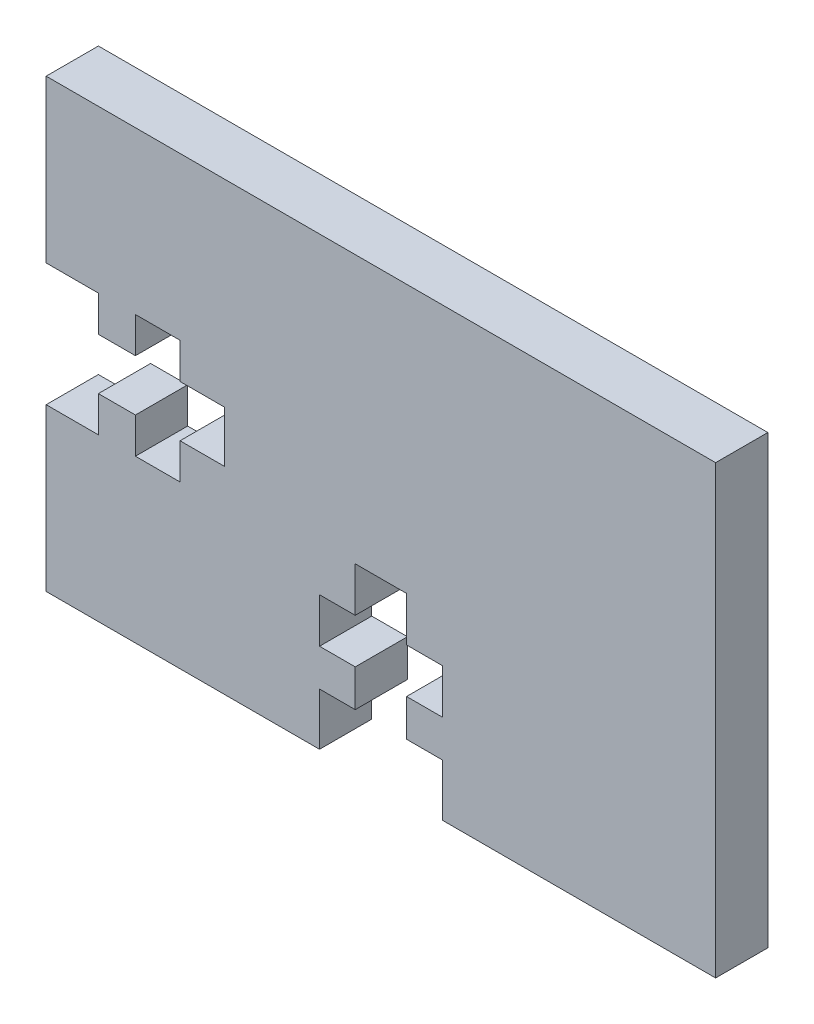
ISO-10303-21;
HEADER;
FILE_DESCRIPTION(('STEP AP214'),'2;1');
FILE_NAME('part.step','',(''),(''),'','','');
FILE_SCHEMA(('AUTOMOTIVE_DESIGN { 1 0 10303 214 1 1 1 1 }'));
ENDSEC;
DATA;
#1=APPLICATION_CONTEXT('core data for automotive mechanical design processes');
#2=APPLICATION_PROTOCOL_DEFINITION('international standard','automotive_design',2000,#1);
#3=PRODUCT_CONTEXT('',#1,'mechanical');
#4=PRODUCT('Part','Part','',(#3));
#5=PRODUCT_RELATED_PRODUCT_CATEGORY('part','',(#4));
#6=PRODUCT_DEFINITION_FORMATION('','',#4);
#7=PRODUCT_DEFINITION_CONTEXT('part definition',#1,'design');
#8=PRODUCT_DEFINITION('design','',#6,#7);
#9=PRODUCT_DEFINITION_SHAPE('','',#8);
#10=(LENGTH_UNIT() NAMED_UNIT(*) SI_UNIT(.MILLI.,.METRE.));
#11=(NAMED_UNIT(*) PLANE_ANGLE_UNIT() SI_UNIT($,.RADIAN.));
#12=(NAMED_UNIT(*) SI_UNIT($,.STERADIAN.) SOLID_ANGLE_UNIT());
#13=UNCERTAINTY_MEASURE_WITH_UNIT(LENGTH_MEASURE(1.E-05),#10,'distance_accuracy_value','');
#14=(GEOMETRIC_REPRESENTATION_CONTEXT(3) GLOBAL_UNCERTAINTY_ASSIGNED_CONTEXT((#13)) GLOBAL_UNIT_ASSIGNED_CONTEXT((#10,
#11,#12)) REPRESENTATION_CONTEXT('',''));
#15=CARTESIAN_POINT('',(0.,0.,0.));
#16=DIRECTION('',(0.,0.,1.));
#17=DIRECTION('',(1.,0.,0.));
#18=AXIS2_PLACEMENT_3D('',#15,#16,#17);
#19=CARTESIAN_POINT('',(20.5105,0.,2.9718));
#20=DIRECTION('',(-1.,0.,0.));
#21=DIRECTION('',(0.,0.,1.));
#22=AXIS2_PLACEMENT_3D('',#19,#20,#21);
#23=PLANE('',#22);
#24=DIRECTION('',(0.,1.,0.));
#25=VECTOR('',#24,1.);
#26=CARTESIAN_POINT('',(20.5105,0.,0.));
#27=LINE('',#26,#25);
#28=CARTESIAN_POINT('',(20.5105,7.62,0.));
#29=VERTEX_POINT('',#28);
#30=CARTESIAN_POINT('',(20.5105,10.16,0.));
#31=VERTEX_POINT('',#30);
#32=EDGE_CURVE('E299',#29,#31,#27,.T.);
#33=ORIENTED_EDGE('',*,*,#32,.F.);
#34=DIRECTION('',(0.,0.,-1.));
#35=VECTOR('',#34,1.);
#36=CARTESIAN_POINT('',(20.5105,7.62,2.9718));
#37=LINE('',#36,#35);
#38=CARTESIAN_POINT('',(20.5105,7.62,2.9718));
#39=VERTEX_POINT('',#38);
#40=EDGE_CURVE('E11',#39,#29,#37,.T.);
#41=ORIENTED_EDGE('',*,*,#40,.F.);
#42=DIRECTION('',(0.,1.,0.));
#43=VECTOR('',#42,1.);
#44=CARTESIAN_POINT('',(20.5105,0.,2.9718));
#45=LINE('',#44,#43);
#46=CARTESIAN_POINT('',(20.5105,10.16,2.9718));
#47=VERTEX_POINT('',#46);
#48=EDGE_CURVE('E386',#39,#47,#45,.T.);
#49=ORIENTED_EDGE('',*,*,#48,.T.);
#50=DIRECTION('',(0.,0.,-1.));
#51=VECTOR('',#50,1.);
#52=CARTESIAN_POINT('',(20.5105,10.16,2.9718));
#53=LINE('',#52,#51);
#54=EDGE_CURVE('E174',#47,#31,#53,.T.);
#55=ORIENTED_EDGE('',*,*,#54,.T.);
#56=EDGE_LOOP('',(#33,#41,#49,#55));
#57=FACE_BOUND('',#56,.T.);
#58=ADVANCED_FACE('F39',(#57),#23,.T.);
#59=CARTESIAN_POINT('',(0.,7.62,2.9718));
#60=DIRECTION('',(0.,-1.,0.));
#61=DIRECTION('',(0.,0.,-1.));
#62=AXIS2_PLACEMENT_3D('',#59,#60,#61);
#63=PLANE('',#62);
#64=DIRECTION('',(-1.,0.,0.));
#65=VECTOR('',#64,1.);
#66=CARTESIAN_POINT('',(0.,7.62,0.));
#67=LINE('',#66,#65);
#68=CARTESIAN_POINT('',(22.5425,7.62,0.));
#69=VERTEX_POINT('',#68);
#70=EDGE_CURVE('E302',#69,#29,#67,.T.);
#71=ORIENTED_EDGE('',*,*,#70,.F.);
#72=DIRECTION('',(0.,0.,-1.));
#73=VECTOR('',#72,1.);
#74=CARTESIAN_POINT('',(22.5425,7.62,2.9718));
#75=LINE('',#74,#73);
#76=CARTESIAN_POINT('',(22.5425,7.62,2.9718));
#77=VERTEX_POINT('',#76);
#78=EDGE_CURVE('E47',#77,#69,#75,.T.);
#79=ORIENTED_EDGE('',*,*,#78,.F.);
#80=DIRECTION('',(-1.,0.,0.));
#81=VECTOR('',#80,1.);
#82=CARTESIAN_POINT('',(0.,7.62,2.9718));
#83=LINE('',#82,#81);
#84=EDGE_CURVE('E483',#77,#39,#83,.T.);
#85=ORIENTED_EDGE('',*,*,#84,.T.);
#86=ORIENTED_EDGE('',*,*,#40,.T.);
#87=EDGE_LOOP('',(#71,#79,#85,#86));
#88=FACE_BOUND('',#87,.T.);
#89=ADVANCED_FACE('F471',(#88),#63,.T.);
#90=CARTESIAN_POINT('',(22.5425,0.,2.9718));
#91=DIRECTION('',(-1.,0.,0.));
#92=DIRECTION('',(0.,0.,1.));
#93=AXIS2_PLACEMENT_3D('',#90,#91,#92);
#94=PLANE('',#93);
#95=DIRECTION('',(0.,1.,0.));
#96=VECTOR('',#95,1.);
#97=CARTESIAN_POINT('',(22.5425,0.,0.));
#98=LINE('',#97,#96);
#99=CARTESIAN_POINT('',(22.5425,5.08,0.));
#100=VERTEX_POINT('',#99);
#101=EDGE_CURVE('E305',#100,#69,#98,.T.);
#102=ORIENTED_EDGE('',*,*,#101,.F.);
#103=DIRECTION('',(0.,0.,-1.));
#104=VECTOR('',#103,1.);
#105=CARTESIAN_POINT('',(22.5425,5.08,2.9718));
#106=LINE('',#105,#104);
#107=CARTESIAN_POINT('',(22.5425,5.08,2.9718));
#108=VERTEX_POINT('',#107);
#109=EDGE_CURVE('E460',#108,#100,#106,.T.);
#110=ORIENTED_EDGE('',*,*,#109,.F.);
#111=DIRECTION('',(0.,1.,0.));
#112=VECTOR('',#111,1.);
#113=CARTESIAN_POINT('',(22.5425,0.,2.9718));
#114=LINE('',#113,#112);
#115=EDGE_CURVE('E467',#108,#77,#114,.T.);
#116=ORIENTED_EDGE('',*,*,#115,.T.);
#117=ORIENTED_EDGE('',*,*,#78,.T.);
#118=EDGE_LOOP('',(#102,#110,#116,#117));
#119=FACE_BOUND('',#118,.T.);
#120=ADVANCED_FACE('F465',(#119),#94,.T.);
#121=CARTESIAN_POINT('',(0.,5.08,2.9718));
#122=DIRECTION('',(0.,1.,0.));
#123=DIRECTION('',(0.,0.,1.));
#124=AXIS2_PLACEMENT_3D('',#121,#122,#123);
#125=PLANE('',#124);
#126=DIRECTION('',(1.,0.,0.));
#127=VECTOR('',#126,1.);
#128=CARTESIAN_POINT('',(0.,5.08,0.));
#129=LINE('',#128,#127);
#130=CARTESIAN_POINT('',(20.5105,5.08,0.));
#131=VERTEX_POINT('',#130);
#132=EDGE_CURVE('E308',#131,#100,#129,.T.);
#133=ORIENTED_EDGE('',*,*,#132,.F.);
#134=DIRECTION('',(0.,0.,-1.));
#135=VECTOR('',#134,1.);
#136=CARTESIAN_POINT('',(20.5105,5.08,2.9718));
#137=LINE('',#136,#135);
#138=CARTESIAN_POINT('',(20.5105,5.08,2.9718));
#139=VERTEX_POINT('',#138);
#140=EDGE_CURVE('E458',#139,#131,#137,.T.);
#141=ORIENTED_EDGE('',*,*,#140,.F.);
#142=DIRECTION('',(1.,0.,0.));
#143=VECTOR('',#142,1.);
#144=CARTESIAN_POINT('',(0.,5.08,2.9718));
#145=LINE('',#144,#143);
#146=EDGE_CURVE('E480',#139,#108,#145,.T.);
#147=ORIENTED_EDGE('',*,*,#146,.T.);
#148=ORIENTED_EDGE('',*,*,#109,.T.);
#149=EDGE_LOOP('',(#133,#141,#147,#148));
#150=FACE_BOUND('',#149,.T.);
#151=ADVANCED_FACE('F477',(#150),#125,.T.);
#152=CARTESIAN_POINT('',(20.5105,0.,2.9718));
#153=DIRECTION('',(-1.,0.,0.));
#154=DIRECTION('',(0.,0.,1.));
#155=AXIS2_PLACEMENT_3D('',#152,#153,#154);
#156=PLANE('',#155);
#157=DIRECTION('',(0.,1.,0.));
#158=VECTOR('',#157,1.);
#159=CARTESIAN_POINT('',(20.5105,0.,0.));
#160=LINE('',#159,#158);
#161=CARTESIAN_POINT('',(20.5105,2.9718,0.));
#162=VERTEX_POINT('',#161);
#163=EDGE_CURVE('E311',#162,#131,#160,.T.);
#164=ORIENTED_EDGE('',*,*,#163,.F.);
#165=DIRECTION('',(0.,0.,-1.));
#166=VECTOR('',#165,1.);
#167=CARTESIAN_POINT('',(20.5105,2.9718,2.9718));
#168=LINE('',#167,#166);
#169=CARTESIAN_POINT('',(20.5105,2.9718,2.9718));
#170=VERTEX_POINT('',#169);
#171=EDGE_CURVE('E456',#170,#162,#168,.T.);
#172=ORIENTED_EDGE('',*,*,#171,.F.);
#173=DIRECTION('',(0.,1.,0.));
#174=VECTOR('',#173,1.);
#175=CARTESIAN_POINT('',(20.5105,0.,2.9718));
#176=LINE('',#175,#174);
#177=EDGE_CURVE('E485',#170,#139,#176,.T.);
#178=ORIENTED_EDGE('',*,*,#177,.T.);
#179=ORIENTED_EDGE('',*,*,#140,.T.);
#180=EDGE_LOOP('',(#164,#172,#178,#179));
#181=FACE_BOUND('',#180,.T.);
#182=ADVANCED_FACE('F577',(#181),#156,.T.);
#183=CARTESIAN_POINT('',(0.,2.9718,2.9718));
#184=DIRECTION('',(0.,-1.,0.));
#185=DIRECTION('',(0.,0.,-1.));
#186=AXIS2_PLACEMENT_3D('',#183,#184,#185);
#187=PLANE('',#186);
#188=DIRECTION('',(-1.,0.,0.));
#189=VECTOR('',#188,1.);
#190=CARTESIAN_POINT('',(0.,2.9718,0.));
#191=LINE('',#190,#189);
#192=CARTESIAN_POINT('',(22.5425,2.9718,0.));
#193=VERTEX_POINT('',#192);
#194=EDGE_CURVE('E314',#193,#162,#191,.T.);
#195=ORIENTED_EDGE('',*,*,#194,.F.);
#196=DIRECTION('',(0.,0.,-1.));
#197=VECTOR('',#196,1.);
#198=CARTESIAN_POINT('',(22.5425,2.9718,2.9718));
#199=LINE('',#198,#197);
#200=CARTESIAN_POINT('',(22.5425,2.9718,2.9718));
#201=VERTEX_POINT('',#200);
#202=EDGE_CURVE('E454',#201,#193,#199,.T.);
#203=ORIENTED_EDGE('',*,*,#202,.F.);
#204=DIRECTION('',(-1.,0.,0.));
#205=VECTOR('',#204,1.);
#206=CARTESIAN_POINT('',(0.,2.9718,2.9718));
#207=LINE('',#206,#205);
#208=EDGE_CURVE('E491',#201,#170,#207,.T.);
#209=ORIENTED_EDGE('',*,*,#208,.T.);
#210=ORIENTED_EDGE('',*,*,#171,.T.);
#211=EDGE_LOOP('',(#195,#203,#209,#210));
#212=FACE_BOUND('',#211,.T.);
#213=ADVANCED_FACE('F580',(#212),#187,.T.);
#214=CARTESIAN_POINT('',(22.5425,0.,2.9718));
#215=DIRECTION('',(-1.,0.,0.));
#216=DIRECTION('',(0.,0.,1.));
#217=AXIS2_PLACEMENT_3D('',#214,#215,#216);
#218=PLANE('',#217);
#219=DIRECTION('',(0.,1.,0.));
#220=VECTOR('',#219,1.);
#221=CARTESIAN_POINT('',(22.5425,0.,0.));
#222=LINE('',#221,#220);
#223=CARTESIAN_POINT('',(22.5425,0.,0.));
#224=VERTEX_POINT('',#223);
#225=EDGE_CURVE('E317',#224,#193,#222,.T.);
#226=ORIENTED_EDGE('',*,*,#225,.F.);
#227=DIRECTION('',(0.,0.,-1.));
#228=VECTOR('',#227,1.);
#229=CARTESIAN_POINT('',(22.5425,0.,2.9718));
#230=LINE('',#229,#228);
#231=CARTESIAN_POINT('',(22.5425,0.,2.9718));
#232=VERTEX_POINT('',#231);
#233=EDGE_CURVE('E452',#232,#224,#230,.T.);
#234=ORIENTED_EDGE('',*,*,#233,.F.);
#235=DIRECTION('',(0.,1.,0.));
#236=VECTOR('',#235,1.);
#237=CARTESIAN_POINT('',(22.5425,0.,2.9718));
#238=LINE('',#237,#236);
#239=EDGE_CURVE('E494',#232,#201,#238,.T.);
#240=ORIENTED_EDGE('',*,*,#239,.T.);
#241=ORIENTED_EDGE('',*,*,#202,.T.);
#242=EDGE_LOOP('',(#226,#234,#240,#241));
#243=FACE_BOUND('',#242,.T.);
#244=ADVANCED_FACE('F584',(#243),#218,.T.);
#245=CARTESIAN_POINT('',(0.,0.,2.9718));
#246=DIRECTION('',(0.,1.,0.));
#247=DIRECTION('',(0.,0.,1.));
#248=AXIS2_PLACEMENT_3D('',#245,#246,#247);
#249=PLANE('',#248);
#250=DIRECTION('',(1.,0.,0.));
#251=VECTOR('',#250,1.);
#252=CARTESIAN_POINT('',(0.,0.,0.));
#253=LINE('',#252,#251);
#254=CARTESIAN_POINT('',(38.1,0.,0.));
#255=VERTEX_POINT('',#254);
#256=EDGE_CURVE('E320',#224,#255,#253,.T.);
#257=ORIENTED_EDGE('',*,*,#256,.T.);
#258=DIRECTION('',(0.,0.,-1.));
#259=VECTOR('',#258,1.);
#260=CARTESIAN_POINT('',(38.1,0.,2.9718));
#261=LINE('',#260,#259);
#262=CARTESIAN_POINT('',(38.1,0.,2.9718));
#263=VERTEX_POINT('',#262);
#264=EDGE_CURVE('E449',#263,#255,#261,.T.);
#265=ORIENTED_EDGE('',*,*,#264,.F.);
#266=DIRECTION('',(1.,0.,0.));
#267=VECTOR('',#266,1.);
#268=CARTESIAN_POINT('',(0.,0.,2.9718));
#269=LINE('',#268,#267);
#270=EDGE_CURVE('E497',#232,#263,#269,.T.);
#271=ORIENTED_EDGE('',*,*,#270,.F.);
#272=ORIENTED_EDGE('',*,*,#233,.T.);
#273=EDGE_LOOP('',(#257,#265,#271,#272));
#274=FACE_BOUND('',#273,.T.);
#275=ADVANCED_FACE('F588',(#274),#249,.F.);
#276=CARTESIAN_POINT('',(38.1,0.,2.9718));
#277=DIRECTION('',(-1.,0.,0.));
#278=DIRECTION('',(0.,0.,1.));
#279=AXIS2_PLACEMENT_3D('',#276,#277,#278);
#280=PLANE('',#279);
#281=DIRECTION('',(0.,1.,0.));
#282=VECTOR('',#281,1.);
#283=CARTESIAN_POINT('',(38.1,0.,0.));
#284=LINE('',#283,#282);
#285=CARTESIAN_POINT('',(38.1,25.4,0.));
#286=VERTEX_POINT('',#285);
#287=EDGE_CURVE('E322',#255,#286,#284,.T.);
#288=ORIENTED_EDGE('',*,*,#287,.T.);
#289=DIRECTION('',(0.,0.,-1.));
#290=VECTOR('',#289,1.);
#291=CARTESIAN_POINT('',(38.1,25.4,2.9718));
#292=LINE('',#291,#290);
#293=CARTESIAN_POINT('',(38.1,25.4,2.9718));
#294=VERTEX_POINT('',#293);
#295=EDGE_CURVE('E447',#294,#286,#292,.T.);
#296=ORIENTED_EDGE('',*,*,#295,.F.);
#297=DIRECTION('',(0.,1.,0.));
#298=VECTOR('',#297,1.);
#299=CARTESIAN_POINT('',(38.1,0.,2.9718));
#300=LINE('',#299,#298);
#301=EDGE_CURVE('E499',#263,#294,#300,.T.);
#302=ORIENTED_EDGE('',*,*,#301,.F.);
#303=ORIENTED_EDGE('',*,*,#264,.T.);
#304=EDGE_LOOP('',(#288,#296,#302,#303));
#305=FACE_BOUND('',#304,.T.);
#306=ADVANCED_FACE('F590',(#305),#280,.F.);
#307=CARTESIAN_POINT('',(0.,25.4,2.9718));
#308=DIRECTION('',(0.,1.,0.));
#309=DIRECTION('',(0.,0.,1.));
#310=AXIS2_PLACEMENT_3D('',#307,#308,#309);
#311=PLANE('',#310);
#312=DIRECTION('',(1.,0.,0.));
#313=VECTOR('',#312,1.);
#314=CARTESIAN_POINT('',(0.,25.4,0.));
#315=LINE('',#314,#313);
#316=CARTESIAN_POINT('',(0.,25.4,0.));
#317=VERTEX_POINT('',#316);
#318=EDGE_CURVE('E326',#317,#286,#315,.T.);
#319=ORIENTED_EDGE('',*,*,#318,.F.);
#320=DIRECTION('',(0.,0.,-1.));
#321=VECTOR('',#320,1.);
#322=CARTESIAN_POINT('',(0.,25.4,2.9718));
#323=LINE('',#322,#321);
#324=CARTESIAN_POINT('',(0.,25.4,2.9718));
#325=VERTEX_POINT('',#324);
#326=EDGE_CURVE('E445',#325,#317,#323,.T.);
#327=ORIENTED_EDGE('',*,*,#326,.F.);
#328=DIRECTION('',(1.,0.,0.));
#329=VECTOR('',#328,1.);
#330=CARTESIAN_POINT('',(0.,25.4,2.9718));
#331=LINE('',#330,#329);
#332=EDGE_CURVE('E502',#325,#294,#331,.T.);
#333=ORIENTED_EDGE('',*,*,#332,.T.);
#334=ORIENTED_EDGE('',*,*,#295,.T.);
#335=EDGE_LOOP('',(#319,#327,#333,#334));
#336=FACE_BOUND('',#335,.T.);
#337=ADVANCED_FACE('F593',(#336),#311,.T.);
#338=CARTESIAN_POINT('',(0.,0.,2.9718));
#339=DIRECTION('',(-1.,0.,0.));
#340=DIRECTION('',(0.,0.,1.));
#341=AXIS2_PLACEMENT_3D('',#338,#339,#340);
#342=PLANE('',#341);
#343=DIRECTION('',(0.,1.,0.));
#344=VECTOR('',#343,1.);
#345=CARTESIAN_POINT('',(0.,0.,0.));
#346=LINE('',#345,#344);
#347=CARTESIAN_POINT('',(0.,16.1925,0.));
#348=VERTEX_POINT('',#347);
#349=EDGE_CURVE('E329',#348,#317,#346,.T.);
#350=ORIENTED_EDGE('',*,*,#349,.F.);
#351=DIRECTION('',(0.,0.,-1.));
#352=VECTOR('',#351,1.);
#353=CARTESIAN_POINT('',(0.,16.1925,2.9718));
#354=LINE('',#353,#352);
#355=CARTESIAN_POINT('',(0.,16.1925,2.9718));
#356=VERTEX_POINT('',#355);
#357=EDGE_CURVE('E443',#356,#348,#354,.T.);
#358=ORIENTED_EDGE('',*,*,#357,.F.);
#359=DIRECTION('',(0.,1.,0.));
#360=VECTOR('',#359,1.);
#361=CARTESIAN_POINT('',(0.,0.,2.9718));
#362=LINE('',#361,#360);
#363=EDGE_CURVE('E505',#356,#325,#362,.T.);
#364=ORIENTED_EDGE('',*,*,#363,.T.);
#365=ORIENTED_EDGE('',*,*,#326,.T.);
#366=EDGE_LOOP('',(#350,#358,#364,#365));
#367=FACE_BOUND('',#366,.T.);
#368=ADVANCED_FACE('F597',(#367),#342,.T.);
#369=CARTESIAN_POINT('',(0.,16.1925,2.9718));
#370=DIRECTION('',(0.,-1.,0.));
#371=DIRECTION('',(0.,0.,-1.));
#372=AXIS2_PLACEMENT_3D('',#369,#370,#371);
#373=PLANE('',#372);
#374=DIRECTION('',(-1.,0.,0.));
#375=VECTOR('',#374,1.);
#376=CARTESIAN_POINT('',(0.,16.1925,0.));
#377=LINE('',#376,#375);
#378=CARTESIAN_POINT('',(2.9718,16.1925,0.));
#379=VERTEX_POINT('',#378);
#380=EDGE_CURVE('E332',#379,#348,#377,.T.);
#381=ORIENTED_EDGE('',*,*,#380,.F.);
#382=DIRECTION('',(0.,0.,-1.));
#383=VECTOR('',#382,1.);
#384=CARTESIAN_POINT('',(2.9718,16.1925,2.9718));
#385=LINE('',#384,#383);
#386=CARTESIAN_POINT('',(2.9718,16.1925,2.9718));
#387=VERTEX_POINT('',#386);
#388=EDGE_CURVE('E441',#387,#379,#385,.T.);
#389=ORIENTED_EDGE('',*,*,#388,.F.);
#390=DIRECTION('',(-1.,0.,0.));
#391=VECTOR('',#390,1.);
#392=CARTESIAN_POINT('',(0.,16.1925,2.9718));
#393=LINE('',#392,#391);
#394=EDGE_CURVE('E508',#387,#356,#393,.T.);
#395=ORIENTED_EDGE('',*,*,#394,.T.);
#396=ORIENTED_EDGE('',*,*,#357,.T.);
#397=EDGE_LOOP('',(#381,#389,#395,#396));
#398=FACE_BOUND('',#397,.T.);
#399=ADVANCED_FACE('F599',(#398),#373,.T.);
#400=CARTESIAN_POINT('',(2.9718,0.,2.9718));
#401=DIRECTION('',(-1.,0.,0.));
#402=DIRECTION('',(0.,0.,1.));
#403=AXIS2_PLACEMENT_3D('',#400,#401,#402);
#404=PLANE('',#403);
#405=DIRECTION('',(0.,1.,0.));
#406=VECTOR('',#405,1.);
#407=CARTESIAN_POINT('',(2.9718,0.,0.));
#408=LINE('',#407,#406);
#409=CARTESIAN_POINT('',(2.9718,14.1605,0.));
#410=VERTEX_POINT('',#409);
#411=EDGE_CURVE('E336',#410,#379,#408,.T.);
#412=ORIENTED_EDGE('',*,*,#411,.F.);
#413=DIRECTION('',(0.,0.,-1.));
#414=VECTOR('',#413,1.);
#415=CARTESIAN_POINT('',(2.9718,14.1605,2.9718));
#416=LINE('',#415,#414);
#417=CARTESIAN_POINT('',(2.9718,14.1605,2.9718));
#418=VERTEX_POINT('',#417);
#419=EDGE_CURVE('E439',#418,#410,#416,.T.);
#420=ORIENTED_EDGE('',*,*,#419,.F.);
#421=DIRECTION('',(0.,1.,0.));
#422=VECTOR('',#421,1.);
#423=CARTESIAN_POINT('',(2.9718,0.,2.9718));
#424=LINE('',#423,#422);
#425=EDGE_CURVE('E512',#418,#387,#424,.T.);
#426=ORIENTED_EDGE('',*,*,#425,.T.);
#427=ORIENTED_EDGE('',*,*,#388,.T.);
#428=EDGE_LOOP('',(#412,#420,#426,#427));
#429=FACE_BOUND('',#428,.T.);
#430=ADVANCED_FACE('F602',(#429),#404,.T.);
#431=CARTESIAN_POINT('',(0.,14.1605,2.9718));
#432=DIRECTION('',(0.,-1.,0.));
#433=DIRECTION('',(0.,0.,-1.));
#434=AXIS2_PLACEMENT_3D('',#431,#432,#433);
#435=PLANE('',#434);
#436=DIRECTION('',(-1.,0.,0.));
#437=VECTOR('',#436,1.);
#438=CARTESIAN_POINT('',(0.,14.1605,0.));
#439=LINE('',#438,#437);
#440=CARTESIAN_POINT('',(5.08,14.1605,0.));
#441=VERTEX_POINT('',#440);
#442=EDGE_CURVE('E339',#441,#410,#439,.T.);
#443=ORIENTED_EDGE('',*,*,#442,.F.);
#444=DIRECTION('',(0.,0.,-1.));
#445=VECTOR('',#444,1.);
#446=CARTESIAN_POINT('',(5.08,14.1605,2.9718));
#447=LINE('',#446,#445);
#448=CARTESIAN_POINT('',(5.08,14.1605,2.9718));
#449=VERTEX_POINT('',#448);
#450=EDGE_CURVE('E437',#449,#441,#447,.T.);
#451=ORIENTED_EDGE('',*,*,#450,.F.);
#452=DIRECTION('',(-1.,0.,0.));
#453=VECTOR('',#452,1.);
#454=CARTESIAN_POINT('',(0.,14.1605,2.9718));
#455=LINE('',#454,#453);
#456=EDGE_CURVE('E515',#449,#418,#455,.T.);
#457=ORIENTED_EDGE('',*,*,#456,.T.);
#458=ORIENTED_EDGE('',*,*,#419,.T.);
#459=EDGE_LOOP('',(#443,#451,#457,#458));
#460=FACE_BOUND('',#459,.T.);
#461=ADVANCED_FACE('F606',(#460),#435,.T.);
#462=CARTESIAN_POINT('',(5.08,0.,2.9718));
#463=DIRECTION('',(-1.,0.,0.));
#464=DIRECTION('',(0.,0.,1.));
#465=AXIS2_PLACEMENT_3D('',#462,#463,#464);
#466=PLANE('',#465);
#467=DIRECTION('',(0.,1.,0.));
#468=VECTOR('',#467,1.);
#469=CARTESIAN_POINT('',(5.08,0.,0.));
#470=LINE('',#469,#468);
#471=CARTESIAN_POINT('',(5.08,16.1925,0.));
#472=VERTEX_POINT('',#471);
#473=EDGE_CURVE('E342',#441,#472,#470,.T.);
#474=ORIENTED_EDGE('',*,*,#473,.T.);
#475=DIRECTION('',(0.,0.,-1.));
#476=VECTOR('',#475,1.);
#477=CARTESIAN_POINT('',(5.08,16.1925,2.9718));
#478=LINE('',#477,#476);
#479=CARTESIAN_POINT('',(5.08,16.1925,2.9718));
#480=VERTEX_POINT('',#479);
#481=EDGE_CURVE('E434',#480,#472,#478,.T.);
#482=ORIENTED_EDGE('',*,*,#481,.F.);
#483=DIRECTION('',(0.,1.,0.));
#484=VECTOR('',#483,1.);
#485=CARTESIAN_POINT('',(5.08,0.,2.9718));
#486=LINE('',#485,#484);
#487=EDGE_CURVE('E518',#449,#480,#486,.T.);
#488=ORIENTED_EDGE('',*,*,#487,.F.);
#489=ORIENTED_EDGE('',*,*,#450,.T.);
#490=EDGE_LOOP('',(#474,#482,#488,#489));
#491=FACE_BOUND('',#490,.T.);
#492=ADVANCED_FACE('F610',(#491),#466,.F.);
#493=CARTESIAN_POINT('',(0.,16.1925,2.9718));
#494=DIRECTION('',(0.,1.,0.));
#495=DIRECTION('',(0.,0.,1.));
#496=AXIS2_PLACEMENT_3D('',#493,#494,#495);
#497=PLANE('',#496);
#498=DIRECTION('',(1.,0.,0.));
#499=VECTOR('',#498,1.);
#500=CARTESIAN_POINT('',(0.,16.1925,0.));
#501=LINE('',#500,#499);
#502=CARTESIAN_POINT('',(7.62,16.1925,0.));
#503=VERTEX_POINT('',#502);
#504=EDGE_CURVE('E344',#472,#503,#501,.T.);
#505=ORIENTED_EDGE('',*,*,#504,.T.);
#506=DIRECTION('',(0.,0.,-1.));
#507=VECTOR('',#506,1.);
#508=CARTESIAN_POINT('',(7.62,16.1925,2.9718));
#509=LINE('',#508,#507);
#510=CARTESIAN_POINT('',(7.62,16.1925,2.9718));
#511=VERTEX_POINT('',#510);
#512=EDGE_CURVE('E431',#511,#503,#509,.T.);
#513=ORIENTED_EDGE('',*,*,#512,.F.);
#514=DIRECTION('',(1.,0.,0.));
#515=VECTOR('',#514,1.);
#516=CARTESIAN_POINT('',(0.,16.1925,2.9718));
#517=LINE('',#516,#515);
#518=EDGE_CURVE('E520',#480,#511,#517,.T.);
#519=ORIENTED_EDGE('',*,*,#518,.F.);
#520=ORIENTED_EDGE('',*,*,#481,.T.);
#521=EDGE_LOOP('',(#505,#513,#519,#520));
#522=FACE_BOUND('',#521,.T.);
#523=ADVANCED_FACE('F614',(#522),#497,.F.);
#524=CARTESIAN_POINT('',(7.62,0.,2.9718));
#525=DIRECTION('',(1.,0.,0.));
#526=DIRECTION('',(0.,0.,-1.));
#527=AXIS2_PLACEMENT_3D('',#524,#525,#526);
#528=PLANE('',#527);
#529=DIRECTION('',(0.,-1.,0.));
#530=VECTOR('',#529,1.);
#531=CARTESIAN_POINT('',(7.62,0.,0.));
#532=LINE('',#531,#530);
#533=CARTESIAN_POINT('',(7.62,14.1605,0.));
#534=VERTEX_POINT('',#533);
#535=EDGE_CURVE('E346',#503,#534,#532,.T.);
#536=ORIENTED_EDGE('',*,*,#535,.T.);
#537=DIRECTION('',(0.,0.,-1.));
#538=VECTOR('',#537,1.);
#539=CARTESIAN_POINT('',(7.62,14.1605,2.9718));
#540=LINE('',#539,#538);
#541=CARTESIAN_POINT('',(7.62,14.1605,2.9718));
#542=VERTEX_POINT('',#541);
#543=EDGE_CURVE('E428',#542,#534,#540,.T.);
#544=ORIENTED_EDGE('',*,*,#543,.F.);
#545=DIRECTION('',(0.,-1.,0.));
#546=VECTOR('',#545,1.);
#547=CARTESIAN_POINT('',(7.62,0.,2.9718));
#548=LINE('',#547,#546);
#549=EDGE_CURVE('E522',#511,#542,#548,.T.);
#550=ORIENTED_EDGE('',*,*,#549,.F.);
#551=ORIENTED_EDGE('',*,*,#512,.T.);
#552=EDGE_LOOP('',(#536,#544,#550,#551));
#553=FACE_BOUND('',#552,.T.);
#554=ADVANCED_FACE('F618',(#553),#528,.F.);
#555=CARTESIAN_POINT('',(0.,14.1605,2.9718));
#556=DIRECTION('',(0.,1.,0.));
#557=DIRECTION('',(0.,0.,1.));
#558=AXIS2_PLACEMENT_3D('',#555,#556,#557);
#559=PLANE('',#558);
#560=DIRECTION('',(1.,0.,0.));
#561=VECTOR('',#560,1.);
#562=CARTESIAN_POINT('',(0.,14.1605,0.));
#563=LINE('',#562,#561);
#564=CARTESIAN_POINT('',(10.16,14.1605,0.));
#565=VERTEX_POINT('',#564);
#566=EDGE_CURVE('E348',#534,#565,#563,.T.);
#567=ORIENTED_EDGE('',*,*,#566,.T.);
#568=DIRECTION('',(0.,0.,-1.));
#569=VECTOR('',#568,1.);
#570=CARTESIAN_POINT('',(10.16,14.1605,2.9718));
#571=LINE('',#570,#569);
#572=CARTESIAN_POINT('',(10.16,14.1605,2.9718));
#573=VERTEX_POINT('',#572);
#574=EDGE_CURVE('E425',#573,#565,#571,.T.);
#575=ORIENTED_EDGE('',*,*,#574,.F.);
#576=DIRECTION('',(1.,0.,0.));
#577=VECTOR('',#576,1.);
#578=CARTESIAN_POINT('',(0.,14.1605,2.9718));
#579=LINE('',#578,#577);
#580=EDGE_CURVE('E524',#542,#573,#579,.T.);
#581=ORIENTED_EDGE('',*,*,#580,.F.);
#582=ORIENTED_EDGE('',*,*,#543,.T.);
#583=EDGE_LOOP('',(#567,#575,#581,#582));
#584=FACE_BOUND('',#583,.T.);
#585=ADVANCED_FACE('F622',(#584),#559,.F.);
#586=CARTESIAN_POINT('',(10.16,0.,2.9718));
#587=DIRECTION('',(1.,0.,0.));
#588=DIRECTION('',(0.,0.,-1.));
#589=AXIS2_PLACEMENT_3D('',#586,#587,#588);
#590=PLANE('',#589);
#591=DIRECTION('',(0.,-1.,0.));
#592=VECTOR('',#591,1.);
#593=CARTESIAN_POINT('',(10.16,0.,0.));
#594=LINE('',#593,#592);
#595=CARTESIAN_POINT('',(10.16,11.2395,0.));
#596=VERTEX_POINT('',#595);
#597=EDGE_CURVE('E350',#565,#596,#594,.T.);
#598=ORIENTED_EDGE('',*,*,#597,.T.);
#599=DIRECTION('',(0.,0.,-1.));
#600=VECTOR('',#599,1.);
#601=CARTESIAN_POINT('',(10.16,11.2395,2.9718));
#602=LINE('',#601,#600);
#603=CARTESIAN_POINT('',(10.16,11.2395,2.9718));
#604=VERTEX_POINT('',#603);
#605=EDGE_CURVE('E423',#604,#596,#602,.T.);
#606=ORIENTED_EDGE('',*,*,#605,.F.);
#607=DIRECTION('',(0.,-1.,0.));
#608=VECTOR('',#607,1.);
#609=CARTESIAN_POINT('',(10.16,0.,2.9718));
#610=LINE('',#609,#608);
#611=EDGE_CURVE('E526',#573,#604,#610,.T.);
#612=ORIENTED_EDGE('',*,*,#611,.F.);
#613=ORIENTED_EDGE('',*,*,#574,.T.);
#614=EDGE_LOOP('',(#598,#606,#612,#613));
#615=FACE_BOUND('',#614,.T.);
#616=ADVANCED_FACE('F626',(#615),#590,.F.);
#617=CARTESIAN_POINT('',(0.,11.2395,2.9718));
#618=DIRECTION('',(0.,1.,0.));
#619=DIRECTION('',(0.,0.,1.));
#620=AXIS2_PLACEMENT_3D('',#617,#618,#619);
#621=PLANE('',#620);
#622=DIRECTION('',(1.,0.,0.));
#623=VECTOR('',#622,1.);
#624=CARTESIAN_POINT('',(0.,11.2395,0.));
#625=LINE('',#624,#623);
#626=CARTESIAN_POINT('',(7.62,11.2395,0.));
#627=VERTEX_POINT('',#626);
#628=EDGE_CURVE('E353',#627,#596,#625,.T.);
#629=ORIENTED_EDGE('',*,*,#628,.F.);
#630=DIRECTION('',(0.,0.,-1.));
#631=VECTOR('',#630,1.);
#632=CARTESIAN_POINT('',(7.62,11.2395,2.9718));
#633=LINE('',#632,#631);
#634=CARTESIAN_POINT('',(7.62,11.2395,2.9718));
#635=VERTEX_POINT('',#634);
#636=EDGE_CURVE('E421',#635,#627,#633,.T.);
#637=ORIENTED_EDGE('',*,*,#636,.F.);
#638=DIRECTION('',(1.,0.,0.));
#639=VECTOR('',#638,1.);
#640=CARTESIAN_POINT('',(0.,11.2395,2.9718));
#641=LINE('',#640,#639);
#642=EDGE_CURVE('E528',#635,#604,#641,.T.);
#643=ORIENTED_EDGE('',*,*,#642,.T.);
#644=ORIENTED_EDGE('',*,*,#605,.T.);
#645=EDGE_LOOP('',(#629,#637,#643,#644));
#646=FACE_BOUND('',#645,.T.);
#647=ADVANCED_FACE('F630',(#646),#621,.T.);
#648=CARTESIAN_POINT('',(7.62,0.,2.9718));
#649=DIRECTION('',(-1.,0.,0.));
#650=DIRECTION('',(0.,0.,1.));
#651=AXIS2_PLACEMENT_3D('',#648,#649,#650);
#652=PLANE('',#651);
#653=DIRECTION('',(0.,1.,0.));
#654=VECTOR('',#653,1.);
#655=CARTESIAN_POINT('',(7.62,0.,0.));
#656=LINE('',#655,#654);
#657=CARTESIAN_POINT('',(7.62,9.2075,0.));
#658=VERTEX_POINT('',#657);
#659=EDGE_CURVE('E356',#658,#627,#656,.T.);
#660=ORIENTED_EDGE('',*,*,#659,.F.);
#661=DIRECTION('',(0.,0.,-1.));
#662=VECTOR('',#661,1.);
#663=CARTESIAN_POINT('',(7.62,9.2075,2.9718));
#664=LINE('',#663,#662);
#665=CARTESIAN_POINT('',(7.62,9.2075,2.9718));
#666=VERTEX_POINT('',#665);
#667=EDGE_CURVE('E419',#666,#658,#664,.T.);
#668=ORIENTED_EDGE('',*,*,#667,.F.);
#669=DIRECTION('',(0.,1.,0.));
#670=VECTOR('',#669,1.);
#671=CARTESIAN_POINT('',(7.62,0.,2.9718));
#672=LINE('',#671,#670);
#673=EDGE_CURVE('E531',#666,#635,#672,.T.);
#674=ORIENTED_EDGE('',*,*,#673,.T.);
#675=ORIENTED_EDGE('',*,*,#636,.T.);
#676=EDGE_LOOP('',(#660,#668,#674,#675));
#677=FACE_BOUND('',#676,.T.);
#678=ADVANCED_FACE('F634',(#677),#652,.T.);
#679=CARTESIAN_POINT('',(0.,9.2075,2.9718));
#680=DIRECTION('',(0.,1.,0.));
#681=DIRECTION('',(0.,0.,1.));
#682=AXIS2_PLACEMENT_3D('',#679,#680,#681);
#683=PLANE('',#682);
#684=DIRECTION('',(1.,0.,0.));
#685=VECTOR('',#684,1.);
#686=CARTESIAN_POINT('',(0.,9.2075,0.));
#687=LINE('',#686,#685);
#688=CARTESIAN_POINT('',(5.08,9.2075,0.));
#689=VERTEX_POINT('',#688);
#690=EDGE_CURVE('E359',#689,#658,#687,.T.);
#691=ORIENTED_EDGE('',*,*,#690,.F.);
#692=DIRECTION('',(0.,0.,-1.));
#693=VECTOR('',#692,1.);
#694=CARTESIAN_POINT('',(5.08,9.2075,2.9718));
#695=LINE('',#694,#693);
#696=CARTESIAN_POINT('',(5.08,9.2075,2.9718));
#697=VERTEX_POINT('',#696);
#698=EDGE_CURVE('E417',#697,#689,#695,.T.);
#699=ORIENTED_EDGE('',*,*,#698,.F.);
#700=DIRECTION('',(1.,0.,0.));
#701=VECTOR('',#700,1.);
#702=CARTESIAN_POINT('',(0.,9.2075,2.9718));
#703=LINE('',#702,#701);
#704=EDGE_CURVE('E534',#697,#666,#703,.T.);
#705=ORIENTED_EDGE('',*,*,#704,.T.);
#706=ORIENTED_EDGE('',*,*,#667,.T.);
#707=EDGE_LOOP('',(#691,#699,#705,#706));
#708=FACE_BOUND('',#707,.T.);
#709=ADVANCED_FACE('F638',(#708),#683,.T.);
#710=CARTESIAN_POINT('',(5.08,0.,2.9718));
#711=DIRECTION('',(1.,0.,0.));
#712=DIRECTION('',(0.,0.,-1.));
#713=AXIS2_PLACEMENT_3D('',#710,#711,#712);
#714=PLANE('',#713);
#715=DIRECTION('',(0.,-1.,0.));
#716=VECTOR('',#715,1.);
#717=CARTESIAN_POINT('',(5.08,0.,0.));
#718=LINE('',#717,#716);
#719=CARTESIAN_POINT('',(5.08,11.2395,0.));
#720=VERTEX_POINT('',#719);
#721=EDGE_CURVE('E362',#720,#689,#718,.T.);
#722=ORIENTED_EDGE('',*,*,#721,.F.);
#723=DIRECTION('',(0.,0.,-1.));
#724=VECTOR('',#723,1.);
#725=CARTESIAN_POINT('',(5.08,11.2395,2.9718));
#726=LINE('',#725,#724);
#727=CARTESIAN_POINT('',(5.08,11.2395,2.9718));
#728=VERTEX_POINT('',#727);
#729=EDGE_CURVE('E415',#728,#720,#726,.T.);
#730=ORIENTED_EDGE('',*,*,#729,.F.);
#731=DIRECTION('',(0.,-1.,0.));
#732=VECTOR('',#731,1.);
#733=CARTESIAN_POINT('',(5.08,0.,2.9718));
#734=LINE('',#733,#732);
#735=EDGE_CURVE('E537',#728,#697,#734,.T.);
#736=ORIENTED_EDGE('',*,*,#735,.T.);
#737=ORIENTED_EDGE('',*,*,#698,.T.);
#738=EDGE_LOOP('',(#722,#730,#736,#737));
#739=FACE_BOUND('',#738,.T.);
#740=ADVANCED_FACE('F642',(#739),#714,.T.);
#741=CARTESIAN_POINT('',(0.,11.2395,2.9718));
#742=DIRECTION('',(0.,-1.,0.));
#743=DIRECTION('',(0.,0.,-1.));
#744=AXIS2_PLACEMENT_3D('',#741,#742,#743);
#745=PLANE('',#744);
#746=DIRECTION('',(-1.,0.,0.));
#747=VECTOR('',#746,1.);
#748=CARTESIAN_POINT('',(0.,11.2395,0.));
#749=LINE('',#748,#747);
#750=CARTESIAN_POINT('',(2.9718,11.2395,0.));
#751=VERTEX_POINT('',#750);
#752=EDGE_CURVE('E365',#720,#751,#749,.T.);
#753=ORIENTED_EDGE('',*,*,#752,.T.);
#754=DIRECTION('',(0.,0.,-1.));
#755=VECTOR('',#754,1.);
#756=CARTESIAN_POINT('',(2.9718,11.2395,2.9718));
#757=LINE('',#756,#755);
#758=CARTESIAN_POINT('',(2.9718,11.2395,2.9718));
#759=VERTEX_POINT('',#758);
#760=EDGE_CURVE('E412',#759,#751,#757,.T.);
#761=ORIENTED_EDGE('',*,*,#760,.F.);
#762=DIRECTION('',(-1.,0.,0.));
#763=VECTOR('',#762,1.);
#764=CARTESIAN_POINT('',(0.,11.2395,2.9718));
#765=LINE('',#764,#763);
#766=EDGE_CURVE('E540',#728,#759,#765,.T.);
#767=ORIENTED_EDGE('',*,*,#766,.F.);
#768=ORIENTED_EDGE('',*,*,#729,.T.);
#769=EDGE_LOOP('',(#753,#761,#767,#768));
#770=FACE_BOUND('',#769,.T.);
#771=ADVANCED_FACE('F646',(#770),#745,.F.);
#772=CARTESIAN_POINT('',(2.97179999999999,0.,2.9718));
#773=DIRECTION('',(1.,0.,0.));
#774=DIRECTION('',(0.,1.,0.));
#775=AXIS2_PLACEMENT_3D('',#772,#773,#774);
#776=PLANE('',#775);
#777=DIRECTION('',(0.,-1.,0.));
#778=VECTOR('',#777,1.);
#779=CARTESIAN_POINT('',(2.97179999999999,0.,0.));
#780=LINE('',#779,#778);
#781=CARTESIAN_POINT('',(2.9718,9.2075,0.));
#782=VERTEX_POINT('',#781);
#783=EDGE_CURVE('E367',#751,#782,#780,.T.);
#784=ORIENTED_EDGE('',*,*,#783,.T.);
#785=DIRECTION('',(0.,0.,-1.));
#786=VECTOR('',#785,1.);
#787=CARTESIAN_POINT('',(2.9718,9.2075,2.9718));
#788=LINE('',#787,#786);
#789=CARTESIAN_POINT('',(2.9718,9.2075,2.9718));
#790=VERTEX_POINT('',#789);
#791=EDGE_CURVE('E409',#790,#782,#788,.T.);
#792=ORIENTED_EDGE('',*,*,#791,.F.);
#793=DIRECTION('',(0.,-1.,0.));
#794=VECTOR('',#793,1.);
#795=CARTESIAN_POINT('',(2.97179999999999,0.,2.9718));
#796=LINE('',#795,#794);
#797=EDGE_CURVE('E542',#759,#790,#796,.T.);
#798=ORIENTED_EDGE('',*,*,#797,.F.);
#799=ORIENTED_EDGE('',*,*,#760,.T.);
#800=EDGE_LOOP('',(#784,#792,#798,#799));
#801=FACE_BOUND('',#800,.T.);
#802=ADVANCED_FACE('F650',(#801),#776,.F.);
#803=CARTESIAN_POINT('',(0.,9.2075,2.9718));
#804=DIRECTION('',(0.,-1.,0.));
#805=DIRECTION('',(0.,0.,-1.));
#806=AXIS2_PLACEMENT_3D('',#803,#804,#805);
#807=PLANE('',#806);
#808=DIRECTION('',(-1.,0.,0.));
#809=VECTOR('',#808,1.);
#810=CARTESIAN_POINT('',(0.,9.2075,0.));
#811=LINE('',#810,#809);
#812=CARTESIAN_POINT('',(0.,9.2075,0.));
#813=VERTEX_POINT('',#812);
#814=EDGE_CURVE('E369',#782,#813,#811,.T.);
#815=ORIENTED_EDGE('',*,*,#814,.T.);
#816=DIRECTION('',(0.,0.,-1.));
#817=VECTOR('',#816,1.);
#818=CARTESIAN_POINT('',(0.,9.2075,2.9718));
#819=LINE('',#818,#817);
#820=CARTESIAN_POINT('',(0.,9.2075,2.9718));
#821=VERTEX_POINT('',#820);
#822=EDGE_CURVE('E407',#821,#813,#819,.T.);
#823=ORIENTED_EDGE('',*,*,#822,.F.);
#824=DIRECTION('',(-1.,0.,0.));
#825=VECTOR('',#824,1.);
#826=CARTESIAN_POINT('',(0.,9.2075,2.9718));
#827=LINE('',#826,#825);
#828=EDGE_CURVE('E544',#790,#821,#827,.T.);
#829=ORIENTED_EDGE('',*,*,#828,.F.);
#830=ORIENTED_EDGE('',*,*,#791,.T.);
#831=EDGE_LOOP('',(#815,#823,#829,#830));
#832=FACE_BOUND('',#831,.T.);
#833=ADVANCED_FACE('F654',(#832),#807,.F.);
#834=CARTESIAN_POINT('',(0.,0.,0.));
#835=VERTEX_POINT('',#834);
#836=EDGE_CURVE('E333',#835,#813,#346,.T.);
#837=ORIENTED_EDGE('',*,*,#836,.F.);
#838=DIRECTION('',(0.,0.,-1.));
#839=VECTOR('',#838,1.);
#840=CARTESIAN_POINT('',(0.,0.,2.9718));
#841=LINE('',#840,#839);
#842=CARTESIAN_POINT('',(0.,0.,2.9718));
#843=VERTEX_POINT('',#842);
#844=EDGE_CURVE('E405',#843,#835,#841,.T.);
#845=ORIENTED_EDGE('',*,*,#844,.F.);
#846=EDGE_CURVE('E509',#843,#821,#362,.T.);
#847=ORIENTED_EDGE('',*,*,#846,.T.);
#848=ORIENTED_EDGE('',*,*,#822,.T.);
#849=EDGE_LOOP('',(#837,#845,#847,#848));
#850=FACE_BOUND('',#849,.T.);
#851=ADVANCED_FACE('F658',(#850),#342,.T.);
#852=CARTESIAN_POINT('',(15.5575,0.,0.));
#853=VERTEX_POINT('',#852);
#854=EDGE_CURVE('E323',#835,#853,#253,.T.);
#855=ORIENTED_EDGE('',*,*,#854,.T.);
#856=DIRECTION('',(0.,0.,-1.));
#857=VECTOR('',#856,1.);
#858=CARTESIAN_POINT('',(15.5575,0.,2.9718));
#859=LINE('',#858,#857);
#860=CARTESIAN_POINT('',(15.5575,0.,2.9718));
#861=VERTEX_POINT('',#860);
#862=EDGE_CURVE('E402',#861,#853,#859,.T.);
#863=ORIENTED_EDGE('',*,*,#862,.F.);
#864=EDGE_CURVE('E500',#843,#861,#269,.T.);
#865=ORIENTED_EDGE('',*,*,#864,.F.);
#866=ORIENTED_EDGE('',*,*,#844,.T.);
#867=EDGE_LOOP('',(#855,#863,#865,#866));
#868=FACE_BOUND('',#867,.T.);
#869=ADVANCED_FACE('F662',(#868),#249,.F.);
#870=CARTESIAN_POINT('',(15.5575,0.,2.9718));
#871=DIRECTION('',(-1.,0.,0.));
#872=DIRECTION('',(0.,-1.,0.));
#873=AXIS2_PLACEMENT_3D('',#870,#871,#872);
#874=PLANE('',#873);
#875=DIRECTION('',(0.,1.,0.));
#876=VECTOR('',#875,1.);
#877=CARTESIAN_POINT('',(15.5575,0.,0.));
#878=LINE('',#877,#876);
#879=CARTESIAN_POINT('',(15.5575,2.9718,0.));
#880=VERTEX_POINT('',#879);
#881=EDGE_CURVE('E372',#853,#880,#878,.T.);
#882=ORIENTED_EDGE('',*,*,#881,.T.);
#883=DIRECTION('',(0.,0.,-1.));
#884=VECTOR('',#883,1.);
#885=CARTESIAN_POINT('',(15.5575,2.9718,2.9718));
#886=LINE('',#885,#884);
#887=CARTESIAN_POINT('',(15.5575,2.9718,2.9718));
#888=VERTEX_POINT('',#887);
#889=EDGE_CURVE('E399',#888,#880,#886,.T.);
#890=ORIENTED_EDGE('',*,*,#889,.F.);
#891=DIRECTION('',(0.,1.,0.));
#892=VECTOR('',#891,1.);
#893=CARTESIAN_POINT('',(15.5575,0.,2.9718));
#894=LINE('',#893,#892);
#895=EDGE_CURVE('E546',#861,#888,#894,.T.);
#896=ORIENTED_EDGE('',*,*,#895,.F.);
#897=ORIENTED_EDGE('',*,*,#862,.T.);
#898=EDGE_LOOP('',(#882,#890,#896,#897));
#899=FACE_BOUND('',#898,.T.);
#900=ADVANCED_FACE('F666',(#899),#874,.F.);
#901=CARTESIAN_POINT('',(0.,2.9718,2.9718));
#902=DIRECTION('',(0.,1.,0.));
#903=DIRECTION('',(0.,0.,1.));
#904=AXIS2_PLACEMENT_3D('',#901,#902,#903);
#905=PLANE('',#904);
#906=DIRECTION('',(1.,0.,0.));
#907=VECTOR('',#906,1.);
#908=CARTESIAN_POINT('',(0.,2.9718,0.));
#909=LINE('',#908,#907);
#910=CARTESIAN_POINT('',(17.5895,2.9718,0.));
#911=VERTEX_POINT('',#910);
#912=EDGE_CURVE('E374',#880,#911,#909,.T.);
#913=ORIENTED_EDGE('',*,*,#912,.T.);
#914=DIRECTION('',(0.,0.,-1.));
#915=VECTOR('',#914,1.);
#916=CARTESIAN_POINT('',(17.5895,2.9718,2.9718));
#917=LINE('',#916,#915);
#918=CARTESIAN_POINT('',(17.5895,2.9718,2.9718));
#919=VERTEX_POINT('',#918);
#920=EDGE_CURVE('E396',#919,#911,#917,.T.);
#921=ORIENTED_EDGE('',*,*,#920,.F.);
#922=DIRECTION('',(1.,0.,0.));
#923=VECTOR('',#922,1.);
#924=CARTESIAN_POINT('',(0.,2.9718,2.9718));
#925=LINE('',#924,#923);
#926=EDGE_CURVE('E548',#888,#919,#925,.T.);
#927=ORIENTED_EDGE('',*,*,#926,.F.);
#928=ORIENTED_EDGE('',*,*,#889,.T.);
#929=EDGE_LOOP('',(#913,#921,#927,#928));
#930=FACE_BOUND('',#929,.T.);
#931=ADVANCED_FACE('F670',(#930),#905,.F.);
#932=CARTESIAN_POINT('',(17.5895,0.,2.9718));
#933=DIRECTION('',(-1.,0.,0.));
#934=DIRECTION('',(0.,0.,1.));
#935=AXIS2_PLACEMENT_3D('',#932,#933,#934);
#936=PLANE('',#935);
#937=DIRECTION('',(0.,1.,0.));
#938=VECTOR('',#937,1.);
#939=CARTESIAN_POINT('',(17.5895,0.,0.));
#940=LINE('',#939,#938);
#941=CARTESIAN_POINT('',(17.5895,5.08,0.));
#942=VERTEX_POINT('',#941);
#943=EDGE_CURVE('E376',#911,#942,#940,.T.);
#944=ORIENTED_EDGE('',*,*,#943,.T.);
#945=DIRECTION('',(0.,0.,-1.));
#946=VECTOR('',#945,1.);
#947=CARTESIAN_POINT('',(17.5895,5.08,2.9718));
#948=LINE('',#947,#946);
#949=CARTESIAN_POINT('',(17.5895,5.08,2.9718));
#950=VERTEX_POINT('',#949);
#951=EDGE_CURVE('E393',#950,#942,#948,.T.);
#952=ORIENTED_EDGE('',*,*,#951,.F.);
#953=DIRECTION('',(0.,1.,0.));
#954=VECTOR('',#953,1.);
#955=CARTESIAN_POINT('',(17.5895,0.,2.9718));
#956=LINE('',#955,#954);
#957=EDGE_CURVE('E550',#919,#950,#956,.T.);
#958=ORIENTED_EDGE('',*,*,#957,.F.);
#959=ORIENTED_EDGE('',*,*,#920,.T.);
#960=EDGE_LOOP('',(#944,#952,#958,#959));
#961=FACE_BOUND('',#960,.T.);
#962=ADVANCED_FACE('F674',(#961),#936,.F.);
#963=CARTESIAN_POINT('',(0.,5.08,2.9718));
#964=DIRECTION('',(0.,-1.,0.));
#965=DIRECTION('',(0.,0.,-1.));
#966=AXIS2_PLACEMENT_3D('',#963,#964,#965);
#967=PLANE('',#966);
#968=DIRECTION('',(-1.,0.,0.));
#969=VECTOR('',#968,1.);
#970=CARTESIAN_POINT('',(0.,5.08,0.));
#971=LINE('',#970,#969);
#972=CARTESIAN_POINT('',(15.5575,5.08,0.));
#973=VERTEX_POINT('',#972);
#974=EDGE_CURVE('E378',#942,#973,#971,.T.);
#975=ORIENTED_EDGE('',*,*,#974,.T.);
#976=DIRECTION('',(0.,0.,-1.));
#977=VECTOR('',#976,1.);
#978=CARTESIAN_POINT('',(15.5575,5.08,2.9718));
#979=LINE('',#978,#977);
#980=CARTESIAN_POINT('',(15.5575,5.08,2.9718));
#981=VERTEX_POINT('',#980);
#982=EDGE_CURVE('E390',#981,#973,#979,.T.);
#983=ORIENTED_EDGE('',*,*,#982,.F.);
#984=DIRECTION('',(-1.,0.,0.));
#985=VECTOR('',#984,1.);
#986=CARTESIAN_POINT('',(0.,5.08,2.9718));
#987=LINE('',#986,#985);
#988=EDGE_CURVE('E552',#950,#981,#987,.T.);
#989=ORIENTED_EDGE('',*,*,#988,.F.);
#990=ORIENTED_EDGE('',*,*,#951,.T.);
#991=EDGE_LOOP('',(#975,#983,#989,#990));
#992=FACE_BOUND('',#991,.T.);
#993=ADVANCED_FACE('F558',(#992),#967,.F.);
#994=CARTESIAN_POINT('',(15.5575,0.,2.9718));
#995=DIRECTION('',(-1.,0.,0.));
#996=DIRECTION('',(0.,0.,1.));
#997=AXIS2_PLACEMENT_3D('',#994,#995,#996);
#998=PLANE('',#997);
#999=DIRECTION('',(0.,1.,0.));
#1000=VECTOR('',#999,1.);
#1001=CARTESIAN_POINT('',(15.5575,0.,0.));
#1002=LINE('',#1001,#1000);
#1003=CARTESIAN_POINT('',(15.5575,7.62,0.));
#1004=VERTEX_POINT('',#1003);
#1005=EDGE_CURVE('E380',#973,#1004,#1002,.T.);
#1006=ORIENTED_EDGE('',*,*,#1005,.T.);
#1007=DIRECTION('',(0.,0.,-1.));
#1008=VECTOR('',#1007,1.);
#1009=CARTESIAN_POINT('',(15.5575,7.62,2.9718));
#1010=LINE('',#1009,#1008);
#1011=CARTESIAN_POINT('',(15.5575,7.62,2.9718));
#1012=VERTEX_POINT('',#1011);
#1013=EDGE_CURVE('E291',#1012,#1004,#1010,.T.);
#1014=ORIENTED_EDGE('',*,*,#1013,.F.);
#1015=DIRECTION('',(0.,1.,0.));
#1016=VECTOR('',#1015,1.);
#1017=CARTESIAN_POINT('',(15.5575,0.,2.9718));
#1018=LINE('',#1017,#1016);
#1019=EDGE_CURVE('E282',#981,#1012,#1018,.T.);
#1020=ORIENTED_EDGE('',*,*,#1019,.F.);
#1021=ORIENTED_EDGE('',*,*,#982,.T.);
#1022=EDGE_LOOP('',(#1006,#1014,#1020,#1021));
#1023=FACE_BOUND('',#1022,.T.);
#1024=ADVANCED_FACE('F562',(#1023),#998,.F.);
#1025=CARTESIAN_POINT('',(0.,7.62,2.9718));
#1026=DIRECTION('',(0.,1.,0.));
#1027=DIRECTION('',(0.,0.,1.));
#1028=AXIS2_PLACEMENT_3D('',#1025,#1026,#1027);
#1029=PLANE('',#1028);
#1030=DIRECTION('',(1.,0.,0.));
#1031=VECTOR('',#1030,1.);
#1032=CARTESIAN_POINT('',(0.,7.62,0.));
#1033=LINE('',#1032,#1031);
#1034=CARTESIAN_POINT('',(17.5895,7.62,0.));
#1035=VERTEX_POINT('',#1034);
#1036=EDGE_CURVE('E290',#1004,#1035,#1033,.T.);
#1037=ORIENTED_EDGE('',*,*,#1036,.T.);
#1038=DIRECTION('',(0.,0.,-1.));
#1039=VECTOR('',#1038,1.);
#1040=CARTESIAN_POINT('',(17.5895,7.62,2.9718));
#1041=LINE('',#1040,#1039);
#1042=CARTESIAN_POINT('',(17.5895,7.62,2.9718));
#1043=VERTEX_POINT('',#1042);
#1044=EDGE_CURVE('E287',#1043,#1035,#1041,.T.);
#1045=ORIENTED_EDGE('',*,*,#1044,.F.);
#1046=DIRECTION('',(1.,0.,0.));
#1047=VECTOR('',#1046,1.);
#1048=CARTESIAN_POINT('',(0.,7.62,2.9718));
#1049=LINE('',#1048,#1047);
#1050=EDGE_CURVE('E276',#1012,#1043,#1049,.T.);
#1051=ORIENTED_EDGE('',*,*,#1050,.F.);
#1052=ORIENTED_EDGE('',*,*,#1013,.T.);
#1053=EDGE_LOOP('',(#1037,#1045,#1051,#1052));
#1054=FACE_BOUND('',#1053,.T.);
#1055=ADVANCED_FACE('F288',(#1054),#1029,.F.);
#1056=CARTESIAN_POINT('',(17.5895,0.,2.9718));
#1057=DIRECTION('',(-1.,0.,0.));
#1058=DIRECTION('',(0.,0.,1.));
#1059=AXIS2_PLACEMENT_3D('',#1056,#1057,#1058);
#1060=PLANE('',#1059);
#1061=DIRECTION('',(0.,1.,0.));
#1062=VECTOR('',#1061,1.);
#1063=CARTESIAN_POINT('',(17.5895,0.,0.));
#1064=LINE('',#1063,#1062);
#1065=CARTESIAN_POINT('',(17.5895,10.16,0.));
#1066=VERTEX_POINT('',#1065);
#1067=EDGE_CURVE('E167',#1035,#1066,#1064,.T.);
#1068=ORIENTED_EDGE('',*,*,#1067,.T.);
#1069=DIRECTION('',(0.,0.,-1.));
#1070=VECTOR('',#1069,1.);
#1071=CARTESIAN_POINT('',(17.5895,10.16,2.9718));
#1072=LINE('',#1071,#1070);
#1073=CARTESIAN_POINT('',(17.5895,10.16,2.9718));
#1074=VERTEX_POINT('',#1073);
#1075=EDGE_CURVE('E292',#1074,#1066,#1072,.T.);
#1076=ORIENTED_EDGE('',*,*,#1075,.F.);
#1077=DIRECTION('',(0.,1.,0.));
#1078=VECTOR('',#1077,1.);
#1079=CARTESIAN_POINT('',(17.5895,0.,2.9718));
#1080=LINE('',#1079,#1078);
#1081=EDGE_CURVE('E280',#1043,#1074,#1080,.T.);
#1082=ORIENTED_EDGE('',*,*,#1081,.F.);
#1083=ORIENTED_EDGE('',*,*,#1044,.T.);
#1084=EDGE_LOOP('',(#1068,#1076,#1082,#1083));
#1085=FACE_BOUND('',#1084,.T.);
#1086=ADVANCED_FACE('F294',(#1085),#1060,.F.);
#1087=CARTESIAN_POINT('',(0.,10.16,2.9718));
#1088=DIRECTION('',(0.,1.,0.));
#1089=DIRECTION('',(0.,0.,1.));
#1090=AXIS2_PLACEMENT_3D('',#1087,#1088,#1089);
#1091=PLANE('',#1090);
#1092=DIRECTION('',(1.,0.,0.));
#1093=VECTOR('',#1092,1.);
#1094=CARTESIAN_POINT('',(0.,10.16,0.));
#1095=LINE('',#1094,#1093);
#1096=EDGE_CURVE('E384',#1066,#31,#1095,.T.);
#1097=ORIENTED_EDGE('',*,*,#1096,.T.);
#1098=ORIENTED_EDGE('',*,*,#54,.F.);
#1099=DIRECTION('',(1.,0.,0.));
#1100=VECTOR('',#1099,1.);
#1101=CARTESIAN_POINT('',(0.,10.16,2.9718));
#1102=LINE('',#1101,#1100);
#1103=EDGE_CURVE('E55',#1074,#47,#1102,.T.);
#1104=ORIENTED_EDGE('',*,*,#1103,.F.);
#1105=ORIENTED_EDGE('',*,*,#1075,.T.);
#1106=EDGE_LOOP('',(#1097,#1098,#1104,#1105));
#1107=FACE_BOUND('',#1106,.T.);
#1108=ADVANCED_FACE('F565',(#1107),#1091,.F.);
#1109=CARTESIAN_POINT('',(0.,0.,2.9718));
#1110=DIRECTION('',(0.,0.,1.));
#1111=DIRECTION('',(1.,0.,0.));
#1112=AXIS2_PLACEMENT_3D('',#1109,#1110,#1111);
#1113=PLANE('',#1112);
#1114=ORIENTED_EDGE('',*,*,#48,.F.);
#1115=ORIENTED_EDGE('',*,*,#84,.F.);
#1116=ORIENTED_EDGE('',*,*,#115,.F.);
#1117=ORIENTED_EDGE('',*,*,#146,.F.);
#1118=ORIENTED_EDGE('',*,*,#177,.F.);
#1119=ORIENTED_EDGE('',*,*,#208,.F.);
#1120=ORIENTED_EDGE('',*,*,#239,.F.);
#1121=ORIENTED_EDGE('',*,*,#270,.T.);
#1122=ORIENTED_EDGE('',*,*,#301,.T.);
#1123=ORIENTED_EDGE('',*,*,#332,.F.);
#1124=ORIENTED_EDGE('',*,*,#363,.F.);
#1125=ORIENTED_EDGE('',*,*,#394,.F.);
#1126=ORIENTED_EDGE('',*,*,#425,.F.);
#1127=ORIENTED_EDGE('',*,*,#456,.F.);
#1128=ORIENTED_EDGE('',*,*,#487,.T.);
#1129=ORIENTED_EDGE('',*,*,#518,.T.);
#1130=ORIENTED_EDGE('',*,*,#549,.T.);
#1131=ORIENTED_EDGE('',*,*,#580,.T.);
#1132=ORIENTED_EDGE('',*,*,#611,.T.);
#1133=ORIENTED_EDGE('',*,*,#642,.F.);
#1134=ORIENTED_EDGE('',*,*,#673,.F.);
#1135=ORIENTED_EDGE('',*,*,#704,.F.);
#1136=ORIENTED_EDGE('',*,*,#735,.F.);
#1137=ORIENTED_EDGE('',*,*,#766,.T.);
#1138=ORIENTED_EDGE('',*,*,#797,.T.);
#1139=ORIENTED_EDGE('',*,*,#828,.T.);
#1140=ORIENTED_EDGE('',*,*,#846,.F.);
#1141=ORIENTED_EDGE('',*,*,#864,.T.);
#1142=ORIENTED_EDGE('',*,*,#895,.T.);
#1143=ORIENTED_EDGE('',*,*,#926,.T.);
#1144=ORIENTED_EDGE('',*,*,#957,.T.);
#1145=ORIENTED_EDGE('',*,*,#988,.T.);
#1146=ORIENTED_EDGE('',*,*,#1019,.T.);
#1147=ORIENTED_EDGE('',*,*,#1050,.T.);
#1148=ORIENTED_EDGE('',*,*,#1081,.T.);
#1149=ORIENTED_EDGE('',*,*,#1103,.T.);
#1150=EDGE_LOOP('',(#1114,#1115,#1116,#1117,#1118,#1119,#1120,#1121,#1122,#1123,#1124,#1125,
#1126,#1127,#1128,#1129,#1130,#1131,#1132,#1133,#1134,#1135,#1136,#1137,#1138,#1139,#1140,#1141,
#1142,#1143,#1144,#1145,#1146,#1147,#1148,#1149));
#1151=FACE_BOUND('',#1150,.T.);
#1152=ADVANCED_FACE('F278',(#1151),#1113,.T.);
#1153=CARTESIAN_POINT('',(0.,0.,0.));
#1154=DIRECTION('',(0.,0.,1.));
#1155=DIRECTION('',(1.,0.,0.));
#1156=AXIS2_PLACEMENT_3D('',#1153,#1154,#1155);
#1157=PLANE('',#1156);
#1158=ORIENTED_EDGE('',*,*,#32,.T.);
#1159=ORIENTED_EDGE('',*,*,#1096,.F.);
#1160=ORIENTED_EDGE('',*,*,#1067,.F.);
#1161=ORIENTED_EDGE('',*,*,#1036,.F.);
#1162=ORIENTED_EDGE('',*,*,#1005,.F.);
#1163=ORIENTED_EDGE('',*,*,#974,.F.);
#1164=ORIENTED_EDGE('',*,*,#943,.F.);
#1165=ORIENTED_EDGE('',*,*,#912,.F.);
#1166=ORIENTED_EDGE('',*,*,#881,.F.);
#1167=ORIENTED_EDGE('',*,*,#854,.F.);
#1168=ORIENTED_EDGE('',*,*,#836,.T.);
#1169=ORIENTED_EDGE('',*,*,#814,.F.);
#1170=ORIENTED_EDGE('',*,*,#783,.F.);
#1171=ORIENTED_EDGE('',*,*,#752,.F.);
#1172=ORIENTED_EDGE('',*,*,#721,.T.);
#1173=ORIENTED_EDGE('',*,*,#690,.T.);
#1174=ORIENTED_EDGE('',*,*,#659,.T.);
#1175=ORIENTED_EDGE('',*,*,#628,.T.);
#1176=ORIENTED_EDGE('',*,*,#597,.F.);
#1177=ORIENTED_EDGE('',*,*,#566,.F.);
#1178=ORIENTED_EDGE('',*,*,#535,.F.);
#1179=ORIENTED_EDGE('',*,*,#504,.F.);
#1180=ORIENTED_EDGE('',*,*,#473,.F.);
#1181=ORIENTED_EDGE('',*,*,#442,.T.);
#1182=ORIENTED_EDGE('',*,*,#411,.T.);
#1183=ORIENTED_EDGE('',*,*,#380,.T.);
#1184=ORIENTED_EDGE('',*,*,#349,.T.);
#1185=ORIENTED_EDGE('',*,*,#318,.T.);
#1186=ORIENTED_EDGE('',*,*,#287,.F.);
#1187=ORIENTED_EDGE('',*,*,#256,.F.);
#1188=ORIENTED_EDGE('',*,*,#225,.T.);
#1189=ORIENTED_EDGE('',*,*,#194,.T.);
#1190=ORIENTED_EDGE('',*,*,#163,.T.);
#1191=ORIENTED_EDGE('',*,*,#132,.T.);
#1192=ORIENTED_EDGE('',*,*,#101,.T.);
#1193=ORIENTED_EDGE('',*,*,#70,.T.);
#1194=EDGE_LOOP('',(#1158,#1159,#1160,#1161,#1162,#1163,#1164,#1165,#1166,#1167,#1168,#1169,
#1170,#1171,#1172,#1173,#1174,#1175,#1176,#1177,#1178,#1179,#1180,#1181,#1182,#1183,#1184,#1185,
#1186,#1187,#1188,#1189,#1190,#1191,#1192,#1193));
#1195=FACE_BOUND('',#1194,.T.);
#1196=ADVANCED_FACE('F473',(#1195),#1157,.F.);
#1197=CLOSED_SHELL('',(#58,#89,#120,#151,#182,#213,#244,#275,#306,#337,#368,#399,#430,#461,#492,
#523,#554,#585,#616,#647,#678,#709,#740,#771,#802,#833,#851,#869,#900,#931,#962,#993,#1024,
#1055,#1086,#1108,#1152,#1196));
#1198=MANIFOLD_SOLID_BREP('B2',#1197);
#1199=ADVANCED_BREP_SHAPE_REPRESENTATION('',(#18,#1198),#14);
#1200=SHAPE_DEFINITION_REPRESENTATION(#9,#1199);
ENDSEC;
END-ISO-10303-21;
